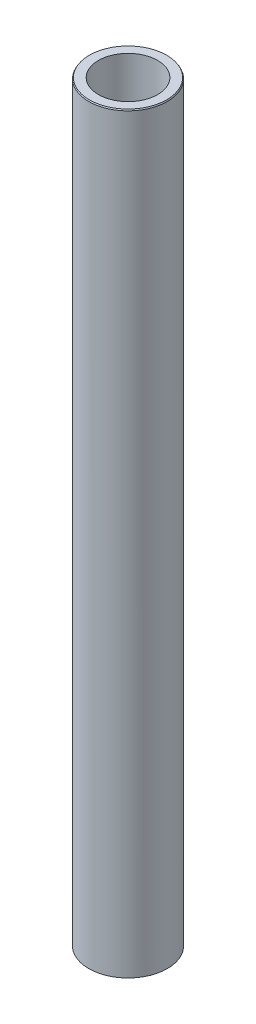
ISO-10303-21;
HEADER;
FILE_DESCRIPTION(('STEP AP214'),'2;1');
FILE_NAME('part.step','',(''),(''),'','','');
FILE_SCHEMA(('AUTOMOTIVE_DESIGN { 1 0 10303 214 1 1 1 1 }'));
ENDSEC;
DATA;
#1=APPLICATION_CONTEXT('core data for automotive mechanical design processes');
#2=APPLICATION_PROTOCOL_DEFINITION('international standard','automotive_design',2000,#1);
#3=PRODUCT_CONTEXT('',#1,'mechanical');
#4=PRODUCT('Part','Part','',(#3));
#5=PRODUCT_RELATED_PRODUCT_CATEGORY('part','',(#4));
#6=PRODUCT_DEFINITION_FORMATION('','',#4);
#7=PRODUCT_DEFINITION_CONTEXT('part definition',#1,'design');
#8=PRODUCT_DEFINITION('design','',#6,#7);
#9=PRODUCT_DEFINITION_SHAPE('','',#8);
#10=(LENGTH_UNIT() NAMED_UNIT(*) SI_UNIT(.MILLI.,.METRE.));
#11=(NAMED_UNIT(*) PLANE_ANGLE_UNIT() SI_UNIT($,.RADIAN.));
#12=(NAMED_UNIT(*) SI_UNIT($,.STERADIAN.) SOLID_ANGLE_UNIT());
#13=UNCERTAINTY_MEASURE_WITH_UNIT(LENGTH_MEASURE(1.E-05),#10,'distance_accuracy_value','');
#14=(GEOMETRIC_REPRESENTATION_CONTEXT(3) GLOBAL_UNCERTAINTY_ASSIGNED_CONTEXT((#13)) GLOBAL_UNIT_ASSIGNED_CONTEXT((#10,
#11,#12)) REPRESENTATION_CONTEXT('',''));
#15=CARTESIAN_POINT('',(0.,0.,0.));
#16=DIRECTION('',(0.,0.,1.));
#17=DIRECTION('',(1.,0.,0.));
#18=AXIS2_PLACEMENT_3D('',#15,#16,#17);
#19=CARTESIAN_POINT('',(0.,430.901800307278,0.));
#20=DIRECTION('',(0.,-1.,0.));
#21=DIRECTION('',(0.,0.,-1.));
#22=AXIS2_PLACEMENT_3D('',#19,#20,#21);
#23=CYLINDRICAL_SURFACE('',#22,22.5);
#24=CARTESIAN_POINT('',(0.,430.256402356525,0.));
#25=DIRECTION('',(0.,1.,0.));
#26=DIRECTION('',(0.,0.,1.));
#27=AXIS2_PLACEMENT_3D('',#24,#25,#26);
#28=CIRCLE('',#27,22.5);
#29=CARTESIAN_POINT('',(0.,430.256402356525,-22.5));
#30=VERTEX_POINT('',#29);
#31=EDGE_CURVE('E50',#30,#30,#28,.F.);
#32=CARTESIAN_POINT('',(0.,0.372620680601676,0.));
#33=DIRECTION('',(0.,1.,0.));
#34=DIRECTION('',(0.,0.,1.));
#35=AXIS2_PLACEMENT_3D('',#32,#33,#34);
#36=CIRCLE('',#35,22.5);
#37=CARTESIAN_POINT('',(0.,0.372620680601676,-22.5));
#38=VERTEX_POINT('',#37);
#39=EDGE_CURVE('E51',#38,#38,#36,.T.);
#40=CARTESIAN_POINT('',(0.,430.256402356525,-22.5));
#41=CARTESIAN_POINT('',(0.,425.778446297401,-22.5));
#42=CARTESIAN_POINT('',(0.,421.300490238277,-22.5));
#43=CARTESIAN_POINT('',(0.,412.344578120029,-22.5));
#44=CARTESIAN_POINT('',(0.,407.866622060904,-22.5));
#45=CARTESIAN_POINT('',(0.,398.910709942656,-22.5));
#46=CARTESIAN_POINT('',(0.,394.432753883532,-22.5));
#47=CARTESIAN_POINT('',(0.,385.476841765283,-22.5));
#48=CARTESIAN_POINT('',(0.,380.998885706159,-22.5));
#49=CARTESIAN_POINT('',(0.,372.042973587911,-22.5));
#50=CARTESIAN_POINT('',(0.,367.565017528786,-22.5));
#51=CARTESIAN_POINT('',(0.,358.609105410538,-22.5));
#52=CARTESIAN_POINT('',(0.,354.131149351414,-22.5));
#53=CARTESIAN_POINT('',(0.,345.175237233165,-22.5));
#54=CARTESIAN_POINT('',(0.,340.697281174041,-22.5));
#55=CARTESIAN_POINT('',(0.,331.741369055793,-22.5));
#56=CARTESIAN_POINT('',(0.,327.263412996669,-22.5));
#57=CARTESIAN_POINT('',(0.,318.30750087842,-22.5));
#58=CARTESIAN_POINT('',(0.,313.829544819296,-22.5));
#59=CARTESIAN_POINT('',(0.,304.873632701048,-22.5));
#60=CARTESIAN_POINT('',(0.,300.395676641923,-22.5));
#61=CARTESIAN_POINT('',(0.,291.439764523675,-22.5));
#62=CARTESIAN_POINT('',(0.,286.961808464551,-22.5));
#63=CARTESIAN_POINT('',(0.,278.005896346302,-22.5));
#64=CARTESIAN_POINT('',(0.,273.527940287178,-22.5));
#65=CARTESIAN_POINT('',(0.,264.57202816893,-22.5));
#66=CARTESIAN_POINT('',(0.,260.094072109806,-22.5));
#67=CARTESIAN_POINT('',(0.,251.138159991557,-22.5));
#68=CARTESIAN_POINT('',(0.,246.660203932433,-22.5));
#69=CARTESIAN_POINT('',(0.,237.704291814185,-22.5));
#70=CARTESIAN_POINT('',(0.,233.22633575506,-22.5));
#71=CARTESIAN_POINT('',(0.,224.270423636812,-22.5));
#72=CARTESIAN_POINT('',(0.,219.792467577688,-22.5));
#73=CARTESIAN_POINT('',(0.,210.836555459439,-22.5));
#74=CARTESIAN_POINT('',(0.,206.358599400315,-22.5));
#75=CARTESIAN_POINT('',(0.,197.402687282067,-22.5));
#76=CARTESIAN_POINT('',(0.,192.924731222942,-22.5));
#77=CARTESIAN_POINT('',(0.,183.968819104694,-22.5));
#78=CARTESIAN_POINT('',(0.,179.49086304557,-22.5));
#79=CARTESIAN_POINT('',(0.,170.534950927321,-22.5));
#80=CARTESIAN_POINT('',(0.,166.056994868197,-22.5));
#81=CARTESIAN_POINT('',(0.,157.101082749949,-22.5));
#82=CARTESIAN_POINT('',(0.,152.623126690825,-22.5));
#83=CARTESIAN_POINT('',(0.,143.667214572576,-22.5));
#84=CARTESIAN_POINT('',(0.,139.189258513452,-22.5));
#85=CARTESIAN_POINT('',(0.,130.233346395204,-22.5));
#86=CARTESIAN_POINT('',(0.,125.755390336079,-22.5));
#87=CARTESIAN_POINT('',(0.,116.799478217831,-22.5));
#88=CARTESIAN_POINT('',(0.,112.321522158707,-22.5));
#89=CARTESIAN_POINT('',(0.,103.365610040458,-22.5));
#90=CARTESIAN_POINT('',(0.,98.8876539813342,-22.5));
#91=CARTESIAN_POINT('',(0.,89.9317418630858,-22.5));
#92=CARTESIAN_POINT('',(0.,85.4537858039616,-22.5));
#93=CARTESIAN_POINT('',(0.,76.4978736857132,-22.5));
#94=CARTESIAN_POINT('',(0.,72.019917626589,-22.5));
#95=CARTESIAN_POINT('',(0.,63.0640055083406,-22.5));
#96=CARTESIAN_POINT('',(0.,58.5860494492164,-22.5));
#97=CARTESIAN_POINT('',(0.,49.630137330968,-22.5));
#98=CARTESIAN_POINT('',(0.,45.1521812718438,-22.5));
#99=CARTESIAN_POINT('',(0.,36.1962691535953,-22.5));
#100=CARTESIAN_POINT('',(0.,31.7183130944711,-22.5));
#101=CARTESIAN_POINT('',(0.,22.7624009762228,-22.5));
#102=CARTESIAN_POINT('',(0.,18.2844449170986,-22.5));
#103=CARTESIAN_POINT('',(0.,9.32853279885014,-22.5));
#104=CARTESIAN_POINT('',(0.,4.85057673972591,-22.5));
#105=CARTESIAN_POINT('',(0.,0.372620680601676,-22.5));
#106=B_SPLINE_CURVE_WITH_KNOTS('',3,(#40,#41,#42,#43,#44,#45,#46,#47,#48,#49,#50,#51,#52,#53,
#54,#55,#56,#57,#58,#59,#60,#61,#62,#63,#64,#65,#66,#67,#68,#69,#70,#71,#72,#73,#74,#75,#76,#77,
#78,#79,#80,#81,#82,#83,#84,#85,#86,#87,#88,#89,#90,#91,#92,#93,#94,#95,#96,#97,#98,#99,#100,
#101,#102,#103,#104,#105),.UNSPECIFIED.,.F.,.F.,(4,2,2,2,2,2,2,2,2,2,2,2,2,2,2,2,2,2,2,2,2,2,2,
2,2,2,2,2,2,2,2,2,4),(0.,13.4338681773726,26.8677363547453,40.3016045321178,53.7354727094905,
67.1693408868631,80.6032090642357,94.0370772416083,107.470945418981,120.904813596354,
134.338681773726,147.772549951099,161.206418128471,174.640286305844,188.074154483217,
201.508022660589,214.941890837962,228.375759015334,241.809627192707,255.24349537008,
268.677363547452,282.111231724825,295.545099902197,308.97896807957,322.412836256943,
335.846704434315,349.280572611688,362.714440789061,376.148308966433,389.582177143806,
403.016045321178,416.449913498551,429.883781675924),.UNSPECIFIED.);
#107=EDGE_CURVE('BSEAM39',#30,#38,#106,.T.);
#108=ORIENTED_EDGE('',*,*,#31,.T.);
#109=ORIENTED_EDGE('',*,*,#39,.T.);
#110=ORIENTED_EDGE('',*,*,#107,.T.);
#111=ORIENTED_EDGE('',*,*,#107,.F.);
#112=EDGE_LOOP('',(#108,#110,#109,#111));
#113=FACE_BOUND('',#112,.T.);
#114=ADVANCED_FACE('F39',(#113),#23,.T.);
#115=CARTESIAN_POINT('',(0.,430.901800307278,0.));
#116=DIRECTION('',(0.,1.,0.));
#117=DIRECTION('',(0.,0.,1.));
#118=AXIS2_PLACEMENT_3D('',#115,#116,#117);
#119=PLANE('',#118);
#120=CARTESIAN_POINT('',(0.,430.901800307278,0.));
#121=DIRECTION('',(0.,1.,0.));
#122=DIRECTION('',(0.,0.,1.));
#123=AXIS2_PLACEMENT_3D('',#120,#121,#122);
#124=CIRCLE('',#123,22.1273793193986);
#125=CARTESIAN_POINT('',(0.,430.901800307278,22.1273793193986));
#126=VERTEX_POINT('',#125);
#127=EDGE_CURVE('E54',#126,#126,#124,.T.);
#128=ORIENTED_EDGE('',*,*,#127,.T.);
#129=EDGE_LOOP('',(#128));
#130=FACE_BOUND('',#129,.T.);
#131=CARTESIAN_POINT('',(0.,430.901800307278,0.));
#132=DIRECTION('',(0.,1.,0.));
#133=DIRECTION('',(0.,0.,1.));
#134=AXIS2_PLACEMENT_3D('',#131,#132,#133);
#135=CIRCLE('',#134,16.9495180702097);
#136=CARTESIAN_POINT('',(0.,430.901800307278,-16.9495180702097));
#137=VERTEX_POINT('',#136);
#138=EDGE_CURVE('E58',#137,#137,#135,.T.);
#139=ORIENTED_EDGE('',*,*,#138,.F.);
#140=EDGE_LOOP('',(#139));
#141=FACE_BOUND('',#140,.T.);
#142=ADVANCED_FACE('F69',(#130,#141),#119,.T.);
#143=CARTESIAN_POINT('',(0.,0.,0.));
#144=DIRECTION('',(0.,1.,0.));
#145=DIRECTION('',(0.,0.,1.));
#146=AXIS2_PLACEMENT_3D('',#143,#144,#145);
#147=PLANE('',#146);
#148=CARTESIAN_POINT('',(0.,0.,0.));
#149=DIRECTION('',(0.,1.,0.));
#150=DIRECTION('',(0.,0.,1.));
#151=AXIS2_PLACEMENT_3D('',#148,#149,#150);
#152=CIRCLE('',#151,21.8546020492469);
#153=CARTESIAN_POINT('',(0.,0.,21.8546020492469));
#154=VERTEX_POINT('',#153);
#155=EDGE_CURVE('E10',#154,#154,#152,.F.);
#156=ORIENTED_EDGE('',*,*,#155,.T.);
#157=EDGE_LOOP('',(#156));
#158=FACE_BOUND('',#157,.T.);
#159=CARTESIAN_POINT('',(0.,0.,0.));
#160=DIRECTION('',(0.,1.,0.));
#161=DIRECTION('',(0.,0.,1.));
#162=AXIS2_PLACEMENT_3D('',#159,#160,#161);
#163=CIRCLE('',#162,16.9495180702097);
#164=CARTESIAN_POINT('',(0.,0.,-16.9495180702097));
#165=VERTEX_POINT('',#164);
#166=EDGE_CURVE('E63',#165,#165,#163,.T.);
#167=ORIENTED_EDGE('',*,*,#166,.T.);
#168=EDGE_LOOP('',(#167));
#169=FACE_BOUND('',#168,.T.);
#170=ADVANCED_FACE('F75',(#158,#169),#147,.F.);
#171=CARTESIAN_POINT('',(0.,430.901800307278,0.));
#172=DIRECTION('',(0.,-1.,0.));
#173=DIRECTION('',(0.,0.,-1.));
#174=AXIS2_PLACEMENT_3D('',#171,#172,#173);
#175=CYLINDRICAL_SURFACE('',#174,16.9495180702097);
#176=CARTESIAN_POINT('',(0.,430.901800307278,-16.9495180702097));
#177=CARTESIAN_POINT('',(0.,426.41323988741,-16.9495180702097));
#178=CARTESIAN_POINT('',(0.,421.924679467543,-16.9495180702097));
#179=CARTESIAN_POINT('',(0.,412.947558627808,-16.9495180702097));
#180=CARTESIAN_POINT('',(0.,408.45899820794,-16.9495180702097));
#181=CARTESIAN_POINT('',(0.,399.481877368206,-16.9495180702097));
#182=CARTESIAN_POINT('',(0.,394.993316948338,-16.9495180702097));
#183=CARTESIAN_POINT('',(0.,386.016196108603,-16.9495180702097));
#184=CARTESIAN_POINT('',(0.,381.527635688736,-16.9495180702097));
#185=CARTESIAN_POINT('',(0.,372.550514849001,-16.9495180702097));
#186=CARTESIAN_POINT('',(0.,368.061954429133,-16.9495180702097));
#187=CARTESIAN_POINT('',(0.,359.084833589398,-16.9495180702097));
#188=CARTESIAN_POINT('',(0.,354.596273169531,-16.9495180702097));
#189=CARTESIAN_POINT('',(0.,345.619152329796,-16.9495180702097));
#190=CARTESIAN_POINT('',(0.,341.130591909928,-16.9495180702097));
#191=CARTESIAN_POINT('',(0.,332.153471070193,-16.9495180702097));
#192=CARTESIAN_POINT('',(0.,327.664910650326,-16.9495180702097));
#193=CARTESIAN_POINT('',(0.,318.687789810591,-16.9495180702097));
#194=CARTESIAN_POINT('',(0.,314.199229390723,-16.9495180702097));
#195=CARTESIAN_POINT('',(0.,305.222108550988,-16.9495180702097));
#196=CARTESIAN_POINT('',(0.,300.733548131121,-16.9495180702097));
#197=CARTESIAN_POINT('',(0.,291.756427291386,-16.9495180702097));
#198=CARTESIAN_POINT('',(0.,287.267866871519,-16.9495180702097));
#199=CARTESIAN_POINT('',(0.,278.290746031784,-16.9495180702097));
#200=CARTESIAN_POINT('',(0.,273.802185611916,-16.9495180702097));
#201=CARTESIAN_POINT('',(0.,264.825064772181,-16.9495180702097));
#202=CARTESIAN_POINT('',(0.,260.336504352314,-16.9495180702097));
#203=CARTESIAN_POINT('',(0.,251.359383512579,-16.9495180702097));
#204=CARTESIAN_POINT('',(0.,246.870823092711,-16.9495180702097));
#205=CARTESIAN_POINT('',(0.,237.893702252976,-16.9495180702097));
#206=CARTESIAN_POINT('',(0.,233.405141833109,-16.9495180702097));
#207=CARTESIAN_POINT('',(0.,224.428020993374,-16.9495180702097));
#208=CARTESIAN_POINT('',(0.,219.939460573506,-16.9495180702097));
#209=CARTESIAN_POINT('',(0.,210.962339733771,-16.9495180702097));
#210=CARTESIAN_POINT('',(0.,206.473779313904,-16.9495180702097));
#211=CARTESIAN_POINT('',(0.,197.496658474169,-16.9495180702097));
#212=CARTESIAN_POINT('',(0.,193.008098054302,-16.9495180702097));
#213=CARTESIAN_POINT('',(0.,184.030977214567,-16.9495180702097));
#214=CARTESIAN_POINT('',(0.,179.542416794699,-16.9495180702097));
#215=CARTESIAN_POINT('',(0.,170.565295954964,-16.9495180702097));
#216=CARTESIAN_POINT('',(0.,166.076735535097,-16.9495180702097));
#217=CARTESIAN_POINT('',(0.,157.099614695362,-16.9495180702097));
#218=CARTESIAN_POINT('',(0.,152.611054275494,-16.9495180702097));
#219=CARTESIAN_POINT('',(0.,143.633933435759,-16.9495180702097));
#220=CARTESIAN_POINT('',(0.,139.145373015892,-16.9495180702097));
#221=CARTESIAN_POINT('',(0.,130.168252176157,-16.9495180702097));
#222=CARTESIAN_POINT('',(0.,125.679691756289,-16.9495180702097));
#223=CARTESIAN_POINT('',(0.,116.702570916554,-16.9495180702097));
#224=CARTESIAN_POINT('',(0.,112.214010496687,-16.9495180702097));
#225=CARTESIAN_POINT('',(0.,103.236889656952,-16.9495180702097));
#226=CARTESIAN_POINT('',(0.,98.7483292370845,-16.9495180702097));
#227=CARTESIAN_POINT('',(0.,89.7712083973495,-16.9495180702097));
#228=CARTESIAN_POINT('',(0.,85.282647977482,-16.9495180702097));
#229=CARTESIAN_POINT('',(0.,76.3055271377471,-16.9495180702097));
#230=CARTESIAN_POINT('',(0.,71.8169667178796,-16.9495180702097));
#231=CARTESIAN_POINT('',(0.,62.8398458781446,-16.9495180702097));
#232=CARTESIAN_POINT('',(0.,58.3512854582771,-16.9495180702097));
#233=CARTESIAN_POINT('',(0.,49.3741646185422,-16.9495180702097));
#234=CARTESIAN_POINT('',(0.,44.8856041986747,-16.9495180702097));
#235=CARTESIAN_POINT('',(0.,35.9084833589398,-16.9495180702097));
#236=CARTESIAN_POINT('',(0.,31.4199229390723,-16.9495180702097));
#237=CARTESIAN_POINT('',(0.,22.4428020993373,-16.9495180702097));
#238=CARTESIAN_POINT('',(0.,17.9542416794699,-16.9495180702097));
#239=CARTESIAN_POINT('',(0.,8.97712083973492,-16.9495180702097));
#240=CARTESIAN_POINT('',(0.,4.48856041986744,-16.9495180702097));
#241=CARTESIAN_POINT('',(0.,0.,-16.9495180702097));
#242=B_SPLINE_CURVE_WITH_KNOTS('',3,(#176,#177,#178,#179,#180,#181,#182,#183,#184,#185,#186,
#187,#188,#189,#190,#191,#192,#193,#194,#195,#196,#197,#198,#199,#200,#201,#202,#203,#204,#205,
#206,#207,#208,#209,#210,#211,#212,#213,#214,#215,#216,#217,#218,#219,#220,#221,#222,#223,#224,
#225,#226,#227,#228,#229,#230,#231,#232,#233,#234,#235,#236,#237,#238,#239,#240,#241),
.UNSPECIFIED.,.F.,.F.,(4,2,2,2,2,2,2,2,2,2,2,2,2,2,2,2,2,2,2,2,2,2,2,2,2,2,2,2,2,2,2,2,4),(0.,
13.4656812596024,26.9313625192049,40.3970437788073,53.8627250384097,67.3284062980121,
80.7940875576146,94.259768817217,107.725450076819,121.191131336422,134.656812596024,
148.122493855627,161.588175115229,175.053856374832,188.519537634434,201.985218894036,
215.450900153639,228.916581413241,242.382262672844,255.847943932446,269.313625192049,
282.779306451651,296.244987711254,309.710668970856,323.176350230458,336.642031490061,
350.107712749663,363.573394009266,377.039075268868,390.504756528471,403.970437788073,
417.436119047675,430.901800307278),.UNSPECIFIED.);
#243=EDGE_CURVE('BSEAM70',#137,#165,#242,.T.);
#244=ORIENTED_EDGE('',*,*,#138,.T.);
#245=ORIENTED_EDGE('',*,*,#166,.F.);
#246=ORIENTED_EDGE('',*,*,#243,.T.);
#247=ORIENTED_EDGE('',*,*,#243,.F.);
#248=EDGE_LOOP('',(#244,#246,#245,#247));
#249=FACE_BOUND('',#248,.T.);
#250=ADVANCED_FACE('F70',(#249),#175,.F.);
#251=CARTESIAN_POINT('',(0.,430.901800307278,0.));
#252=DIRECTION('',(0.,-1.,0.));
#253=DIRECTION('',(0.,0.,-1.));
#254=AXIS2_PLACEMENT_3D('',#251,#252,#253);
#255=CONICAL_SURFACE('',#254,22.1273793193986,0.523598775598278);
#256=ORIENTED_EDGE('',*,*,#31,.F.);
#257=EDGE_LOOP('',(#256));
#258=FACE_BOUND('',#257,.T.);
#259=ORIENTED_EDGE('',*,*,#127,.F.);
#260=EDGE_LOOP('',(#259));
#261=FACE_BOUND('',#260,.T.);
#262=ADVANCED_FACE('F81',(#258,#261),#255,.T.);
#263=CARTESIAN_POINT('',(0.,0.372620680601676,0.));
#264=DIRECTION('',(0.,1.,0.));
#265=DIRECTION('',(0.,0.,1.));
#266=AXIS2_PLACEMENT_3D('',#263,#264,#265);
#267=CONICAL_SURFACE('',#266,22.5,1.04719755119664);
#268=ORIENTED_EDGE('',*,*,#155,.F.);
#269=EDGE_LOOP('',(#268));
#270=FACE_BOUND('',#269,.T.);
#271=ORIENTED_EDGE('',*,*,#39,.F.);
#272=EDGE_LOOP('',(#271));
#273=FACE_BOUND('',#272,.T.);
#274=ADVANCED_FACE('F45',(#270,#273),#267,.T.);
#275=CLOSED_SHELL('',(#114,#142,#170,#250,#262,#274));
#276=MANIFOLD_SOLID_BREP('B2',#275);
#277=ADVANCED_BREP_SHAPE_REPRESENTATION('',(#18,#276),#14);
#278=SHAPE_DEFINITION_REPRESENTATION(#9,#277);
ENDSEC;
END-ISO-10303-21;
